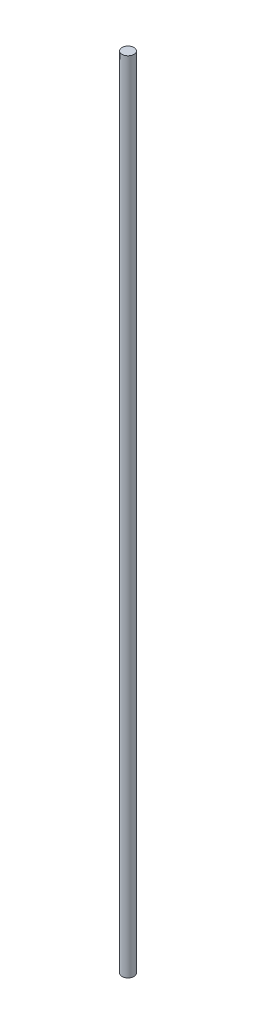
ISO-10303-21;
HEADER;
FILE_DESCRIPTION(('STEP AP214'),'2;1');
FILE_NAME('part.step','',(''),(''),'','','');
FILE_SCHEMA(('AUTOMOTIVE_DESIGN { 1 0 10303 214 1 1 1 1 }'));
ENDSEC;
DATA;
#1=APPLICATION_CONTEXT('core data for automotive mechanical design processes');
#2=APPLICATION_PROTOCOL_DEFINITION('international standard','automotive_design',2000,#1);
#3=PRODUCT_CONTEXT('',#1,'mechanical');
#4=PRODUCT('Part','Part','',(#3));
#5=PRODUCT_RELATED_PRODUCT_CATEGORY('part','',(#4));
#6=PRODUCT_DEFINITION_FORMATION('','',#4);
#7=PRODUCT_DEFINITION_CONTEXT('part definition',#1,'design');
#8=PRODUCT_DEFINITION('design','',#6,#7);
#9=PRODUCT_DEFINITION_SHAPE('','',#8);
#10=(LENGTH_UNIT() NAMED_UNIT(*) SI_UNIT(.MILLI.,.METRE.));
#11=(NAMED_UNIT(*) PLANE_ANGLE_UNIT() SI_UNIT($,.RADIAN.));
#12=(NAMED_UNIT(*) SI_UNIT($,.STERADIAN.) SOLID_ANGLE_UNIT());
#13=UNCERTAINTY_MEASURE_WITH_UNIT(LENGTH_MEASURE(1.E-05),#10,'distance_accuracy_value','');
#14=(GEOMETRIC_REPRESENTATION_CONTEXT(3) GLOBAL_UNCERTAINTY_ASSIGNED_CONTEXT((#13)) GLOBAL_UNIT_ASSIGNED_CONTEXT((#10,
#11,#12)) REPRESENTATION_CONTEXT('',''));
#15=CARTESIAN_POINT('',(0.,0.,0.));
#16=DIRECTION('',(0.,0.,1.));
#17=DIRECTION('',(1.,0.,0.));
#18=AXIS2_PLACEMENT_3D('',#15,#16,#17);
#19=CARTESIAN_POINT('',(0.,200.,0.));
#20=DIRECTION('',(0.,-1.,0.));
#21=DIRECTION('',(0.,0.,-1.));
#22=AXIS2_PLACEMENT_3D('',#19,#20,#21);
#23=CYLINDRICAL_SURFACE('',#22,1.5);
#24=CARTESIAN_POINT('',(0.,200.,0.));
#25=DIRECTION('',(0.,1.,0.));
#26=DIRECTION('',(0.,0.,1.));
#27=AXIS2_PLACEMENT_3D('',#24,#25,#26);
#28=CIRCLE('',#27,1.5);
#29=CARTESIAN_POINT('',(0.,200.,1.5));
#30=VERTEX_POINT('',#29);
#31=EDGE_CURVE('E10',#30,#30,#28,.T.);
#32=ORIENTED_EDGE('',*,*,#31,.F.);
#33=EDGE_LOOP('',(#32));
#34=FACE_BOUND('',#33,.T.);
#35=CARTESIAN_POINT('',(0.,0.,0.));
#36=DIRECTION('',(0.,1.,0.));
#37=DIRECTION('',(0.,0.,1.));
#38=AXIS2_PLACEMENT_3D('',#35,#36,#37);
#39=CIRCLE('',#38,1.5);
#40=CARTESIAN_POINT('',(0.,0.,1.5));
#41=VERTEX_POINT('',#40);
#42=EDGE_CURVE('E36',#41,#41,#39,.T.);
#43=ORIENTED_EDGE('',*,*,#42,.T.);
#44=EDGE_LOOP('',(#43));
#45=FACE_BOUND('',#44,.T.);
#46=ADVANCED_FACE('F33',(#34,#45),#23,.T.);
#47=CARTESIAN_POINT('',(0.,200.,0.));
#48=DIRECTION('',(0.,1.,0.));
#49=DIRECTION('',(0.,0.,1.));
#50=AXIS2_PLACEMENT_3D('',#47,#48,#49);
#51=PLANE('',#50);
#52=ORIENTED_EDGE('',*,*,#31,.T.);
#53=EDGE_LOOP('',(#52));
#54=FACE_BOUND('',#53,.T.);
#55=ADVANCED_FACE('F48',(#54),#51,.T.);
#56=CARTESIAN_POINT('',(0.,0.,0.));
#57=DIRECTION('',(0.,1.,0.));
#58=DIRECTION('',(0.,0.,1.));
#59=AXIS2_PLACEMENT_3D('',#56,#57,#58);
#60=PLANE('',#59);
#61=ORIENTED_EDGE('',*,*,#42,.F.);
#62=EDGE_LOOP('',(#61));
#63=FACE_BOUND('',#62,.T.);
#64=ADVANCED_FACE('F46',(#63),#60,.F.);
#65=CLOSED_SHELL('',(#46,#55,#64));
#66=MANIFOLD_SOLID_BREP('B2',#65);
#67=ADVANCED_BREP_SHAPE_REPRESENTATION('',(#18,#66),#14);
#68=SHAPE_DEFINITION_REPRESENTATION(#9,#67);
ENDSEC;
END-ISO-10303-21;
